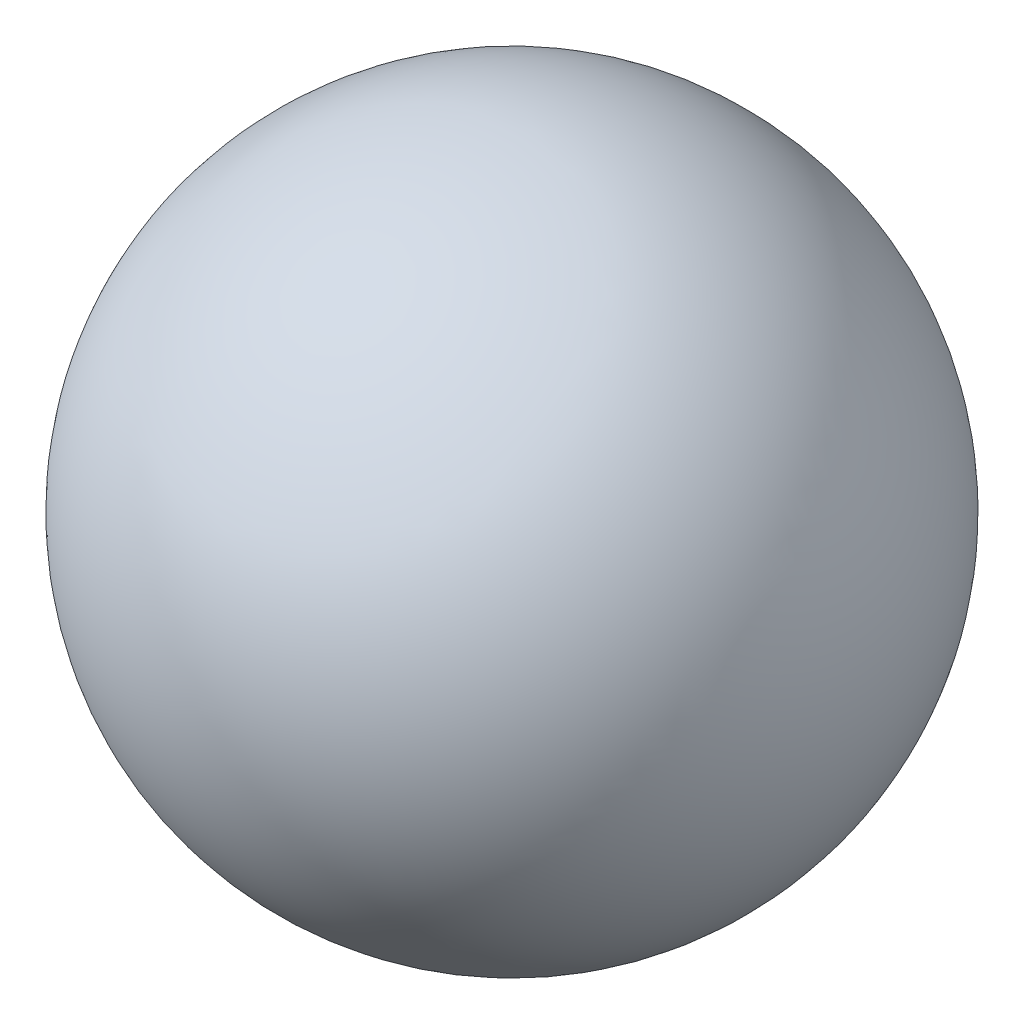
ISO-10303-21;
HEADER;
FILE_DESCRIPTION(('STEP AP214'),'2;1');
FILE_NAME('part.step','',(''),(''),'','','');
FILE_SCHEMA(('AUTOMOTIVE_DESIGN { 1 0 10303 214 1 1 1 1 }'));
ENDSEC;
DATA;
#1=APPLICATION_CONTEXT('core data for automotive mechanical design processes');
#2=APPLICATION_PROTOCOL_DEFINITION('international standard','automotive_design',2000,#1);
#3=PRODUCT_CONTEXT('',#1,'mechanical');
#4=PRODUCT('Part','Part','',(#3));
#5=PRODUCT_RELATED_PRODUCT_CATEGORY('part','',(#4));
#6=PRODUCT_DEFINITION_FORMATION('','',#4);
#7=PRODUCT_DEFINITION_CONTEXT('part definition',#1,'design');
#8=PRODUCT_DEFINITION('design','',#6,#7);
#9=PRODUCT_DEFINITION_SHAPE('','',#8);
#10=(LENGTH_UNIT() NAMED_UNIT(*) SI_UNIT(.MILLI.,.METRE.));
#11=(NAMED_UNIT(*) PLANE_ANGLE_UNIT() SI_UNIT($,.RADIAN.));
#12=(NAMED_UNIT(*) SI_UNIT($,.STERADIAN.) SOLID_ANGLE_UNIT());
#13=UNCERTAINTY_MEASURE_WITH_UNIT(LENGTH_MEASURE(1.E-05),#10,'distance_accuracy_value','');
#14=(GEOMETRIC_REPRESENTATION_CONTEXT(3) GLOBAL_UNCERTAINTY_ASSIGNED_CONTEXT((#13)) GLOBAL_UNIT_ASSIGNED_CONTEXT((#10,
#11,#12)) REPRESENTATION_CONTEXT('',''));
#15=CARTESIAN_POINT('',(0.,0.,0.));
#16=DIRECTION('',(0.,0.,1.));
#17=DIRECTION('',(1.,0.,0.));
#18=AXIS2_PLACEMENT_3D('',#15,#16,#17);
#19=CARTESIAN_POINT('',(0.,0.,0.));
#20=DIRECTION('',(-1.,0.,0.));
#21=DIRECTION('',(0.,1.,0.));
#22=AXIS2_PLACEMENT_3D('',#19,#20,#21);
#23=SPHERICAL_SURFACE('',#22,66.4512152141623);
#24=CARTESIAN_POINT('',(-66.4512152141623,0.,0.));
#25=VERTEX_POINT('',#24);
#26=VERTEX_LOOP('',#25);
#27=FACE_BOUND('',#26,.T.);
#28=ADVANCED_FACE('F28',(#27),#23,.T.);
#29=CLOSED_SHELL('',(#28));
#30=MANIFOLD_SOLID_BREP('B2',#29);
#31=ADVANCED_BREP_SHAPE_REPRESENTATION('',(#18,#30),#14);
#32=SHAPE_DEFINITION_REPRESENTATION(#9,#31);
ENDSEC;
END-ISO-10303-21;
